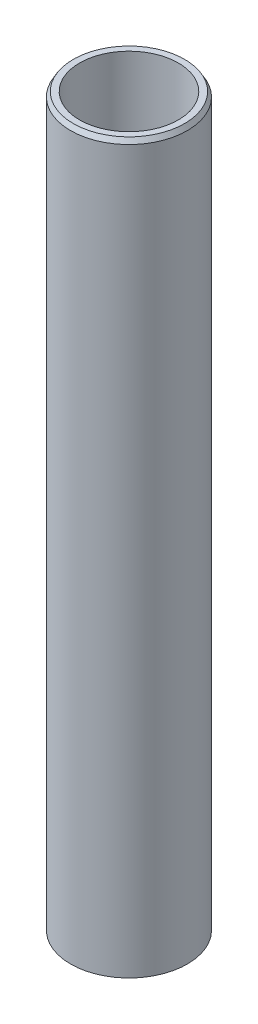
ISO-10303-21;
HEADER;
FILE_DESCRIPTION(('STEP AP214'),'2;1');
FILE_NAME('part.step','',(''),(''),'','','');
FILE_SCHEMA(('AUTOMOTIVE_DESIGN { 1 0 10303 214 1 1 1 1 }'));
ENDSEC;
DATA;
#1=APPLICATION_CONTEXT('core data for automotive mechanical design processes');
#2=APPLICATION_PROTOCOL_DEFINITION('international standard','automotive_design',2000,#1);
#3=PRODUCT_CONTEXT('',#1,'mechanical');
#4=PRODUCT('Part','Part','',(#3));
#5=PRODUCT_RELATED_PRODUCT_CATEGORY('part','',(#4));
#6=PRODUCT_DEFINITION_FORMATION('','',#4);
#7=PRODUCT_DEFINITION_CONTEXT('part definition',#1,'design');
#8=PRODUCT_DEFINITION('design','',#6,#7);
#9=PRODUCT_DEFINITION_SHAPE('','',#8);
#10=(LENGTH_UNIT() NAMED_UNIT(*) SI_UNIT(.MILLI.,.METRE.));
#11=(NAMED_UNIT(*) PLANE_ANGLE_UNIT() SI_UNIT($,.RADIAN.));
#12=(NAMED_UNIT(*) SI_UNIT($,.STERADIAN.) SOLID_ANGLE_UNIT());
#13=UNCERTAINTY_MEASURE_WITH_UNIT(LENGTH_MEASURE(1.E-05),#10,'distance_accuracy_value','');
#14=(GEOMETRIC_REPRESENTATION_CONTEXT(3) GLOBAL_UNCERTAINTY_ASSIGNED_CONTEXT((#13)) GLOBAL_UNIT_ASSIGNED_CONTEXT((#10,
#11,#12)) REPRESENTATION_CONTEXT('',''));
#15=CARTESIAN_POINT('',(0.,0.,0.));
#16=DIRECTION('',(0.,0.,1.));
#17=DIRECTION('',(1.,0.,0.));
#18=AXIS2_PLACEMENT_3D('',#15,#16,#17);
#19=CARTESIAN_POINT('',(0.,437.111828961542,0.));
#20=DIRECTION('',(0.,-1.,0.));
#21=DIRECTION('',(0.,0.,-1.));
#22=AXIS2_PLACEMENT_3D('',#19,#20,#21);
#23=CYLINDRICAL_SURFACE('',#22,35.);
#24=CARTESIAN_POINT('',(0.,434.280279539604,0.));
#25=DIRECTION('',(0.,1.,0.));
#26=DIRECTION('',(0.,0.,1.));
#27=AXIS2_PLACEMENT_3D('',#24,#25,#26);
#28=CIRCLE('',#27,35.);
#29=CARTESIAN_POINT('',(0.,434.280279539604,35.));
#30=VERTEX_POINT('',#29);
#31=EDGE_CURVE('E50',#30,#30,#28,.F.);
#32=ORIENTED_EDGE('',*,*,#31,.T.);
#33=EDGE_LOOP('',(#32));
#34=FACE_BOUND('',#33,.T.);
#35=CARTESIAN_POINT('',(0.,1.63479582097942,0.));
#36=DIRECTION('',(0.,1.,0.));
#37=DIRECTION('',(0.,0.,1.));
#38=AXIS2_PLACEMENT_3D('',#35,#36,#37);
#39=CIRCLE('',#38,35.);
#40=CARTESIAN_POINT('',(0.,1.63479582097942,35.));
#41=VERTEX_POINT('',#40);
#42=EDGE_CURVE('E51',#41,#41,#39,.T.);
#43=ORIENTED_EDGE('',*,*,#42,.T.);
#44=EDGE_LOOP('',(#43));
#45=FACE_BOUND('',#44,.T.);
#46=ADVANCED_FACE('F39',(#34,#45),#23,.T.);
#47=CARTESIAN_POINT('',(0.,437.111828961542,0.));
#48=DIRECTION('',(0.,1.,0.));
#49=DIRECTION('',(0.,0.,1.));
#50=AXIS2_PLACEMENT_3D('',#47,#48,#49);
#51=PLANE('',#50);
#52=CARTESIAN_POINT('',(0.,437.111828961542,0.));
#53=DIRECTION('',(0.,1.,0.));
#54=DIRECTION('',(0.,0.,1.));
#55=AXIS2_PLACEMENT_3D('',#52,#53,#54);
#56=CIRCLE('',#55,33.3652041790205);
#57=CARTESIAN_POINT('',(0.,437.111828961542,33.3652041790205));
#58=VERTEX_POINT('',#57);
#59=EDGE_CURVE('E54',#58,#58,#56,.T.);
#60=ORIENTED_EDGE('',*,*,#59,.T.);
#61=EDGE_LOOP('',(#60));
#62=FACE_BOUND('',#61,.T.);
#63=CARTESIAN_POINT('',(0.,437.111828961542,0.));
#64=DIRECTION('',(0.,1.,0.));
#65=DIRECTION('',(0.,0.,1.));
#66=AXIS2_PLACEMENT_3D('',#63,#64,#65);
#67=CIRCLE('',#66,29.5936295660463);
#68=CARTESIAN_POINT('',(0.,437.111828961542,29.5936295660463));
#69=VERTEX_POINT('',#68);
#70=EDGE_CURVE('E58',#69,#69,#67,.T.);
#71=ORIENTED_EDGE('',*,*,#70,.F.);
#72=EDGE_LOOP('',(#71));
#73=FACE_BOUND('',#72,.T.);
#74=ADVANCED_FACE('F69',(#62,#73),#51,.T.);
#75=CARTESIAN_POINT('',(0.,0.,0.));
#76=DIRECTION('',(0.,1.,0.));
#77=DIRECTION('',(0.,0.,1.));
#78=AXIS2_PLACEMENT_3D('',#75,#76,#77);
#79=PLANE('',#78);
#80=CARTESIAN_POINT('',(0.,0.,0.));
#81=DIRECTION('',(0.,1.,0.));
#82=DIRECTION('',(0.,0.,1.));
#83=AXIS2_PLACEMENT_3D('',#80,#81,#82);
#84=CIRCLE('',#83,32.1684505780624);
#85=CARTESIAN_POINT('',(0.,0.,32.1684505780624));
#86=VERTEX_POINT('',#85);
#87=EDGE_CURVE('E10',#86,#86,#84,.F.);
#88=ORIENTED_EDGE('',*,*,#87,.T.);
#89=EDGE_LOOP('',(#88));
#90=FACE_BOUND('',#89,.T.);
#91=CARTESIAN_POINT('',(0.,0.,0.));
#92=DIRECTION('',(0.,1.,0.));
#93=DIRECTION('',(0.,0.,1.));
#94=AXIS2_PLACEMENT_3D('',#91,#92,#93);
#95=CIRCLE('',#94,29.5936295660463);
#96=CARTESIAN_POINT('',(0.,0.,29.5936295660463));
#97=VERTEX_POINT('',#96);
#98=EDGE_CURVE('E63',#97,#97,#95,.T.);
#99=ORIENTED_EDGE('',*,*,#98,.T.);
#100=EDGE_LOOP('',(#99));
#101=FACE_BOUND('',#100,.T.);
#102=ADVANCED_FACE('F75',(#90,#101),#79,.F.);
#103=CARTESIAN_POINT('',(0.,437.111828961542,0.));
#104=DIRECTION('',(0.,-1.,0.));
#105=DIRECTION('',(0.,0.,-1.));
#106=AXIS2_PLACEMENT_3D('',#103,#104,#105);
#107=CYLINDRICAL_SURFACE('',#106,29.5936295660463);
#108=ORIENTED_EDGE('',*,*,#70,.T.);
#109=EDGE_LOOP('',(#108));
#110=FACE_BOUND('',#109,.T.);
#111=ORIENTED_EDGE('',*,*,#98,.F.);
#112=EDGE_LOOP('',(#111));
#113=FACE_BOUND('',#112,.T.);
#114=ADVANCED_FACE('F70',(#110,#113),#107,.F.);
#115=CARTESIAN_POINT('',(0.,437.111828961542,0.));
#116=DIRECTION('',(0.,-1.,0.));
#117=DIRECTION('',(0.,0.,-1.));
#118=AXIS2_PLACEMENT_3D('',#115,#116,#117);
#119=CONICAL_SURFACE('',#118,33.3652041790205,0.523598775598288);
#120=ORIENTED_EDGE('',*,*,#31,.F.);
#121=EDGE_LOOP('',(#120));
#122=FACE_BOUND('',#121,.T.);
#123=ORIENTED_EDGE('',*,*,#59,.F.);
#124=EDGE_LOOP('',(#123));
#125=FACE_BOUND('',#124,.T.);
#126=ADVANCED_FACE('F81',(#122,#125),#119,.T.);
#127=CARTESIAN_POINT('',(0.,1.63479582097942,0.));
#128=DIRECTION('',(0.,1.,0.));
#129=DIRECTION('',(0.,0.,1.));
#130=AXIS2_PLACEMENT_3D('',#127,#128,#129);
#131=CONICAL_SURFACE('',#130,35.,1.0471975511966);
#132=ORIENTED_EDGE('',*,*,#87,.F.);
#133=EDGE_LOOP('',(#132));
#134=FACE_BOUND('',#133,.T.);
#135=ORIENTED_EDGE('',*,*,#42,.F.);
#136=EDGE_LOOP('',(#135));
#137=FACE_BOUND('',#136,.T.);
#138=ADVANCED_FACE('F45',(#134,#137),#131,.T.);
#139=CLOSED_SHELL('',(#46,#74,#102,#114,#126,#138));
#140=MANIFOLD_SOLID_BREP('B2',#139);
#141=ADVANCED_BREP_SHAPE_REPRESENTATION('',(#18,#140),#14);
#142=SHAPE_DEFINITION_REPRESENTATION(#9,#141);
ENDSEC;
END-ISO-10303-21;
